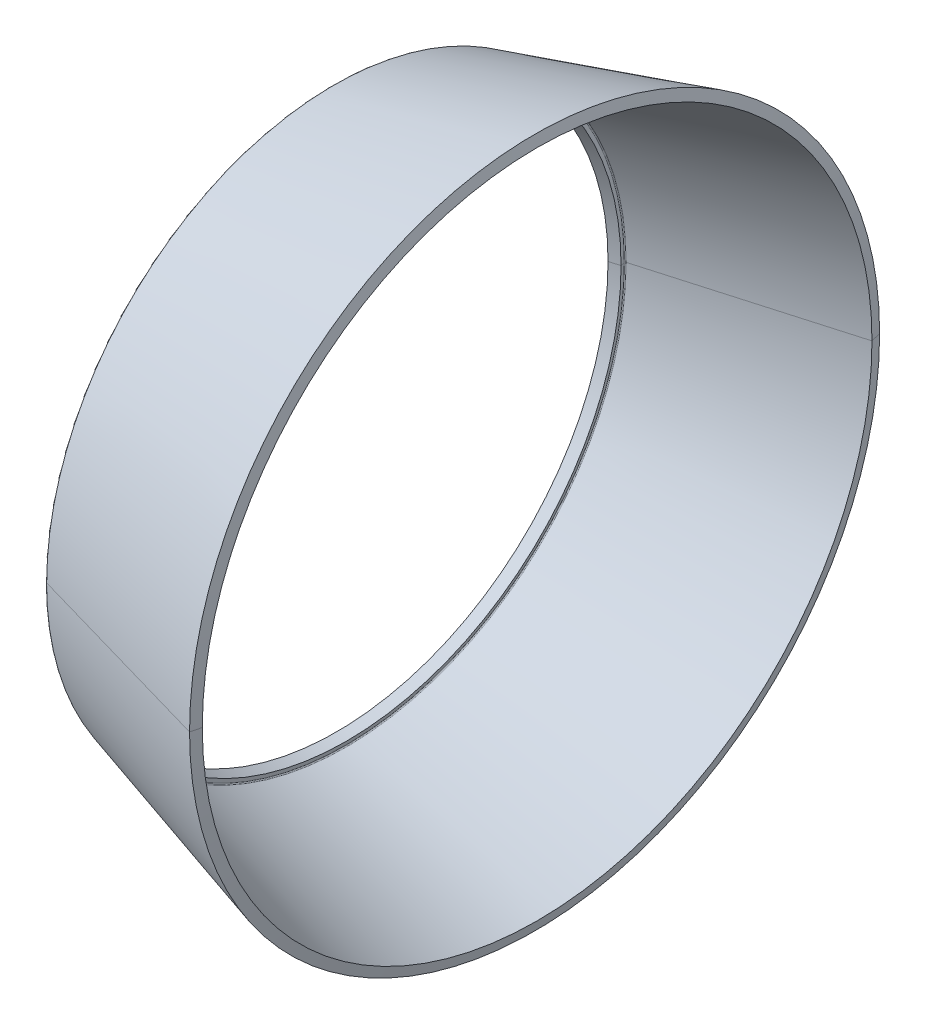
ISO-10303-21;
HEADER;
FILE_DESCRIPTION(('STEP AP214'),'2;1');
FILE_NAME('part.step','',(''),(''),'','','');
FILE_SCHEMA(('AUTOMOTIVE_DESIGN { 1 0 10303 214 1 1 1 1 }'));
ENDSEC;
DATA;
#1=APPLICATION_CONTEXT('core data for automotive mechanical design processes');
#2=APPLICATION_PROTOCOL_DEFINITION('international standard','automotive_design',2000,#1);
#3=PRODUCT_CONTEXT('',#1,'mechanical');
#4=PRODUCT('Part','Part','',(#3));
#5=PRODUCT_RELATED_PRODUCT_CATEGORY('part','',(#4));
#6=PRODUCT_DEFINITION_FORMATION('','',#4);
#7=PRODUCT_DEFINITION_CONTEXT('part definition',#1,'design');
#8=PRODUCT_DEFINITION('design','',#6,#7);
#9=PRODUCT_DEFINITION_SHAPE('','',#8);
#10=(LENGTH_UNIT() NAMED_UNIT(*) SI_UNIT(.MILLI.,.METRE.));
#11=(NAMED_UNIT(*) PLANE_ANGLE_UNIT() SI_UNIT($,.RADIAN.));
#12=(NAMED_UNIT(*) SI_UNIT($,.STERADIAN.) SOLID_ANGLE_UNIT());
#13=UNCERTAINTY_MEASURE_WITH_UNIT(LENGTH_MEASURE(1.E-05),#10,'distance_accuracy_value','');
#14=(GEOMETRIC_REPRESENTATION_CONTEXT(3) GLOBAL_UNCERTAINTY_ASSIGNED_CONTEXT((#13)) GLOBAL_UNIT_ASSIGNED_CONTEXT((#10,
#11,#12)) REPRESENTATION_CONTEXT('',''));
#15=CARTESIAN_POINT('',(0.,0.,0.));
#16=DIRECTION('',(0.,0.,1.));
#17=DIRECTION('',(1.,0.,0.));
#18=AXIS2_PLACEMENT_3D('',#15,#16,#17);
#19=CARTESIAN_POINT('',(19.537827678837,0.,0.));
#20=DIRECTION('',(1.,0.,0.));
#21=DIRECTION('',(0.,1.,0.));
#22=AXIS2_PLACEMENT_3D('',#19,#20,#21);
#23=CONICAL_SURFACE('',#22,32.850014997691,0.279985718604932);
#24=DIRECTION('',(0.96105938495696,0.,0.276341923323535));
#25=VECTOR('',#24,1.);
#26=CARTESIAN_POINT('',(0.444051428440808,0.,27.359812274391));
#27=LINE('',#26,#25);
#28=CARTESIAN_POINT('',(0.444051428440808,0.,27.359812274391));
#29=VERTEX_POINT('',#28);
#30=CARTESIAN_POINT('',(19.537827678837,0.,32.850014997691));
#31=VERTEX_POINT('',#30);
#32=EDGE_CURVE('E11',#29,#31,#27,.T.);
#33=ORIENTED_EDGE('',*,*,#32,.F.);
#34=CARTESIAN_POINT('',(0.444051428440819,0.,0.));
#35=DIRECTION('',(1.,0.,0.));
#36=DIRECTION('',(0.,0.,-1.));
#37=AXIS2_PLACEMENT_3D('',#34,#35,#36);
#38=CIRCLE('',#37,27.359812274391);
#39=CARTESIAN_POINT('',(0.444051428440815,-26.0207277481717,-8.4546469556951));
#40=VERTEX_POINT('',#39);
#41=EDGE_CURVE('E25',#29,#40,#38,.T.);
#42=ORIENTED_EDGE('',*,*,#41,.T.);
#43=CARTESIAN_POINT('',(0.444051428440819,0.,0.));
#44=DIRECTION('',(1.,0.,0.));
#45=DIRECTION('',(0.,0.,-1.));
#46=AXIS2_PLACEMENT_3D('',#43,#44,#45);
#47=CIRCLE('',#46,27.359812274391);
#48=CARTESIAN_POINT('',(0.444051428440819,0.,-27.359812274391));
#49=VERTEX_POINT('',#48);
#50=EDGE_CURVE('E385',#40,#49,#47,.T.);
#51=ORIENTED_EDGE('',*,*,#50,.T.);
#52=DIRECTION('',(0.96105938495696,0.,-0.276341923323535));
#53=VECTOR('',#52,1.);
#54=CARTESIAN_POINT('',(0.444051428440808,0.,-27.359812274391));
#55=LINE('',#54,#53);
#56=CARTESIAN_POINT('',(19.537827678837,0.,-32.850014997691));
#57=VERTEX_POINT('',#56);
#58=EDGE_CURVE('E125',#49,#57,#55,.T.);
#59=ORIENTED_EDGE('',*,*,#58,.T.);
#60=CARTESIAN_POINT('',(19.537827678837,0.,0.));
#61=DIRECTION('',(1.,0.,0.));
#62=DIRECTION('',(0.,0.,-1.));
#63=AXIS2_PLACEMENT_3D('',#60,#61,#62);
#64=CIRCLE('',#63,32.850014997691);
#65=EDGE_CURVE('E377',#31,#57,#64,.T.);
#66=ORIENTED_EDGE('',*,*,#65,.F.);
#67=EDGE_LOOP('',(#33,#42,#51,#59,#66));
#68=FACE_BOUND('',#67,.T.);
#69=ADVANCED_FACE('F17',(#68),#23,.T.);
#70=CARTESIAN_POINT('',(19.78050790391,0.,0.));
#71=DIRECTION('',(-1.,0.,0.));
#72=DIRECTION('',(0.,1.,0.));
#73=AXIS2_PLACEMENT_3D('',#70,#71,#72);
#74=CONICAL_SURFACE('',#73,31.879276566275,1.32582191298443);
#75=DIRECTION('',(-0.242531502591709,0.,-0.970143530747182));
#76=VECTOR('',#75,1.);
#77=CARTESIAN_POINT('',(19.78050790391,0.,-31.879276566275));
#78=LINE('',#77,#76);
#79=CARTESIAN_POINT('',(19.78050790391,0.,-31.879276566275));
#80=VERTEX_POINT('',#79);
#81=EDGE_CURVE('E372',#80,#57,#78,.T.);
#82=ORIENTED_EDGE('',*,*,#81,.F.);
#83=CARTESIAN_POINT('',(19.78050790391,0.,0.));
#84=DIRECTION('',(1.,0.,0.));
#85=DIRECTION('',(0.,0.,-1.));
#86=AXIS2_PLACEMENT_3D('',#83,#84,#85);
#87=CIRCLE('',#86,31.879276566275);
#88=CARTESIAN_POINT('',(19.78050790391,0.,31.879276566275));
#89=VERTEX_POINT('',#88);
#90=EDGE_CURVE('E367',#89,#80,#87,.T.);
#91=ORIENTED_EDGE('',*,*,#90,.F.);
#92=DIRECTION('',(-0.242531502591705,0.,0.970143530747183));
#93=VECTOR('',#92,1.);
#94=CARTESIAN_POINT('',(19.78050790391,0.,31.879276566275));
#95=LINE('',#94,#93);
#96=EDGE_CURVE('E362',#89,#31,#95,.T.);
#97=ORIENTED_EDGE('',*,*,#96,.T.);
#98=ORIENTED_EDGE('',*,*,#65,.T.);
#99=EDGE_LOOP('',(#82,#91,#97,#98));
#100=FACE_BOUND('',#99,.T.);
#101=ADVANCED_FACE('F426',(#100),#74,.T.);
#102=CARTESIAN_POINT('',(19.78050790391,0.,0.));
#103=DIRECTION('',(-1.,0.,0.));
#104=DIRECTION('',(0.,-1.,0.));
#105=AXIS2_PLACEMENT_3D('',#102,#103,#104);
#106=CONICAL_SURFACE('',#105,31.879276566275,1.32582191298443);
#107=ORIENTED_EDGE('',*,*,#81,.T.);
#108=CARTESIAN_POINT('',(19.537827678837,0.,0.));
#109=DIRECTION('',(1.,0.,0.));
#110=DIRECTION('',(0.,0.,-1.));
#111=AXIS2_PLACEMENT_3D('',#108,#109,#110);
#112=CIRCLE('',#111,32.850014997691);
#113=EDGE_CURVE('E357',#57,#31,#112,.T.);
#114=ORIENTED_EDGE('',*,*,#113,.T.);
#115=ORIENTED_EDGE('',*,*,#96,.F.);
#116=CARTESIAN_POINT('',(19.78050790391,0.,0.));
#117=DIRECTION('',(1.,0.,0.));
#118=DIRECTION('',(0.,0.,-1.));
#119=AXIS2_PLACEMENT_3D('',#116,#117,#118);
#120=CIRCLE('',#119,31.879276566275);
#121=EDGE_CURVE('E352',#80,#89,#120,.T.);
#122=ORIENTED_EDGE('',*,*,#121,.F.);
#123=EDGE_LOOP('',(#107,#114,#115,#122));
#124=FACE_BOUND('',#123,.T.);
#125=ADVANCED_FACE('F430',(#124),#106,.T.);
#126=CARTESIAN_POINT('',(1.6019810178151,0.,0.));
#127=DIRECTION('',(1.,0.,0.));
#128=DIRECTION('',(0.,-1.,0.));
#129=AXIS2_PLACEMENT_3D('',#126,#127,#128);
#130=CONICAL_SURFACE('',#129,26.652243605022,0.279985718604906);
#131=DIRECTION('',(0.961059384956967,0.,0.27634192332351));
#132=VECTOR('',#131,1.);
#133=CARTESIAN_POINT('',(1.6019810178151,0.,26.652243605022));
#134=LINE('',#133,#132);
#135=CARTESIAN_POINT('',(1.6019810178151,0.,26.652243605022));
#136=VERTEX_POINT('',#135);
#137=EDGE_CURVE('E340',#136,#89,#134,.T.);
#138=ORIENTED_EDGE('',*,*,#137,.F.);
#139=CARTESIAN_POINT('',(1.6019810178151,0.,0.));
#140=DIRECTION('',(1.,0.,0.));
#141=DIRECTION('',(0.,0.,-1.));
#142=AXIS2_PLACEMENT_3D('',#139,#140,#141);
#143=CIRCLE('',#142,26.652243605022);
#144=CARTESIAN_POINT('',(1.6019810178151,25.347789954442,8.23599621217281));
#145=VERTEX_POINT('',#144);
#146=EDGE_CURVE('E337',#145,#136,#143,.T.);
#147=ORIENTED_EDGE('',*,*,#146,.F.);
#148=CARTESIAN_POINT('',(1.6019810178151,0.,0.));
#149=DIRECTION('',(1.,0.,0.));
#150=DIRECTION('',(0.,0.,-1.));
#151=AXIS2_PLACEMENT_3D('',#148,#149,#150);
#152=CIRCLE('',#151,26.652243605022);
#153=CARTESIAN_POINT('',(1.6019810178151,0.,-26.652243605022));
#154=VERTEX_POINT('',#153);
#155=EDGE_CURVE('E330',#154,#145,#152,.T.);
#156=ORIENTED_EDGE('',*,*,#155,.F.);
#157=DIRECTION('',(0.961059384956967,0.,-0.27634192332351));
#158=VECTOR('',#157,1.);
#159=CARTESIAN_POINT('',(1.6019810178151,0.,-26.652243605022));
#160=LINE('',#159,#158);
#161=EDGE_CURVE('E338',#154,#80,#160,.T.);
#162=ORIENTED_EDGE('',*,*,#161,.T.);
#163=ORIENTED_EDGE('',*,*,#121,.T.);
#164=EDGE_LOOP('',(#138,#147,#156,#162,#163));
#165=FACE_BOUND('',#164,.T.);
#166=ADVANCED_FACE('F435',(#165),#130,.F.);
#167=CARTESIAN_POINT('',(1.6019810178151,0.,0.));
#168=DIRECTION('',(1.,0.,0.));
#169=DIRECTION('',(0.,1.,0.));
#170=AXIS2_PLACEMENT_3D('',#167,#168,#169);
#171=CONICAL_SURFACE('',#170,26.652243605022,0.279985718604906);
#172=ORIENTED_EDGE('',*,*,#137,.T.);
#173=ORIENTED_EDGE('',*,*,#90,.T.);
#174=ORIENTED_EDGE('',*,*,#161,.F.);
#175=CARTESIAN_POINT('',(1.6019810178151,0.,0.));
#176=DIRECTION('',(1.,0.,0.));
#177=DIRECTION('',(0.,0.,-1.));
#178=AXIS2_PLACEMENT_3D('',#175,#176,#177);
#179=CIRCLE('',#178,26.652243605022);
#180=CARTESIAN_POINT('',(1.6019810178151,-25.347789954442,-8.2359962121728));
#181=VERTEX_POINT('',#180);
#182=EDGE_CURVE('E333',#181,#154,#179,.T.);
#183=ORIENTED_EDGE('',*,*,#182,.F.);
#184=CARTESIAN_POINT('',(1.6019810178151,0.,0.));
#185=DIRECTION('',(1.,0.,0.));
#186=DIRECTION('',(0.,0.,-1.));
#187=AXIS2_PLACEMENT_3D('',#184,#185,#186);
#188=CIRCLE('',#187,26.652243605022);
#189=EDGE_CURVE('E447',#136,#181,#188,.T.);
#190=ORIENTED_EDGE('',*,*,#189,.F.);
#191=EDGE_LOOP('',(#172,#173,#174,#183,#190));
#192=FACE_BOUND('',#191,.T.);
#193=ADVANCED_FACE('F301',(#192),#171,.F.);
#194=CARTESIAN_POINT('',(1.62961521014821,0.,0.));
#195=DIRECTION('',(1.,0.,0.));
#196=DIRECTION('',(0.,0.309016994374947,-0.951056516295154));
#197=AXIS2_PLACEMENT_3D('',#194,#195,#196);
#198=TOROIDAL_SURFACE('',#197,26.5561376665258,0.100000000000678);
#199=CARTESIAN_POINT('',(1.62961521014821,-25.2563877753805,-8.20629784391713));
#200=DIRECTION('',(0.,0.309016994374948,-0.951056516295153));
#201=DIRECTION('',(-0.276341923329143,-0.914021790608395,-0.296983682554738));
#202=AXIS2_PLACEMENT_3D('',#199,#200,#201);
#203=CIRCLE('',#202,0.100000000000676);
#204=CARTESIAN_POINT('',(1.5326008570727,-25.2333216587862,-8.19880320832003));
#205=VERTEX_POINT('',#204);
#206=EDGE_CURVE('E448',#181,#205,#203,.T.);
#207=ORIENTED_EDGE('',*,*,#206,.T.);
#208=CARTESIAN_POINT('',(1.5326008570727,0.,0.));
#209=DIRECTION('',(1.,0.,0.));
#210=DIRECTION('',(0.,0.,1.));
#211=AXIS2_PLACEMENT_3D('',#208,#209,#210);
#212=CIRCLE('',#211,26.531884516267);
#213=CARTESIAN_POINT('',(1.5326008570727,0.,26.531884516267));
#214=VERTEX_POINT('',#213);
#215=EDGE_CURVE('E267',#214,#205,#212,.T.);
#216=ORIENTED_EDGE('',*,*,#215,.F.);
#217=CARTESIAN_POINT('',(1.5326008570727,0.,0.));
#218=DIRECTION('',(1.,0.,0.));
#219=DIRECTION('',(0.,0.951056516295156,0.309016994374939));
#220=AXIS2_PLACEMENT_3D('',#217,#218,#219);
#221=CIRCLE('',#220,26.531884516267);
#222=CARTESIAN_POINT('',(1.5326008570727,25.2333216587862,8.19880320832003));
#223=VERTEX_POINT('',#222);
#224=EDGE_CURVE('E242',#223,#214,#221,.T.);
#225=ORIENTED_EDGE('',*,*,#224,.F.);
#226=CARTESIAN_POINT('',(1.62961521014821,25.2563877753805,8.20629784391713));
#227=DIRECTION('',(0.,-0.309016994374948,0.951056516295153));
#228=DIRECTION('',(-0.276341923329141,0.914021790608396,0.296983682554738));
#229=AXIS2_PLACEMENT_3D('',#226,#227,#228);
#230=CIRCLE('',#229,0.100000000000676);
#231=EDGE_CURVE('E324',#145,#223,#230,.T.);
#232=ORIENTED_EDGE('',*,*,#231,.F.);
#233=ORIENTED_EDGE('',*,*,#146,.T.);
#234=ORIENTED_EDGE('',*,*,#189,.T.);
#235=EDGE_LOOP('',(#207,#216,#225,#232,#233,#234));
#236=FACE_BOUND('',#235,.T.);
#237=ADVANCED_FACE('F296',(#236),#198,.F.);
#238=CARTESIAN_POINT('',(1.62961521014821,0.,0.));
#239=DIRECTION('',(1.,0.,0.));
#240=DIRECTION('',(0.,-0.309016994374947,0.951056516295154));
#241=AXIS2_PLACEMENT_3D('',#238,#239,#240);
#242=TOROIDAL_SURFACE('',#241,26.5561376665258,0.100000000000678);
#243=ORIENTED_EDGE('',*,*,#206,.F.);
#244=ORIENTED_EDGE('',*,*,#182,.T.);
#245=ORIENTED_EDGE('',*,*,#155,.T.);
#246=ORIENTED_EDGE('',*,*,#231,.T.);
#247=CARTESIAN_POINT('',(1.5326008570727,0.,0.));
#248=DIRECTION('',(1.,0.,0.));
#249=DIRECTION('',(0.,0.,-1.));
#250=AXIS2_PLACEMENT_3D('',#247,#248,#249);
#251=CIRCLE('',#250,26.531884516267);
#252=CARTESIAN_POINT('',(1.5326008570727,0.,-26.531884516267));
#253=VERTEX_POINT('',#252);
#254=EDGE_CURVE('E326',#253,#223,#251,.T.);
#255=ORIENTED_EDGE('',*,*,#254,.F.);
#256=CARTESIAN_POINT('',(1.5326008570727,0.,0.));
#257=DIRECTION('',(1.,0.,0.));
#258=DIRECTION('',(0.,-0.951056516295153,-0.30901699437495));
#259=AXIS2_PLACEMENT_3D('',#256,#257,#258);
#260=CIRCLE('',#259,26.531884516267);
#261=EDGE_CURVE('E256',#205,#253,#260,.T.);
#262=ORIENTED_EDGE('',*,*,#261,.F.);
#263=EDGE_LOOP('',(#243,#244,#245,#246,#255,#262));
#264=FACE_BOUND('',#263,.T.);
#265=ADVANCED_FACE('F287',(#264),#242,.F.);
#266=CARTESIAN_POINT('',(1.6305224286618,0.,0.));
#267=DIRECTION('',(-1.,0.,0.));
#268=DIRECTION('',(0.,1.,0.));
#269=AXIS2_PLACEMENT_3D('',#266,#267,#268);
#270=CONICAL_SURFACE('',#269,26.140191156094,1.32582191298489);
#271=DIRECTION('',(-0.24253150259126,0.,-0.970143530747294));
#272=VECTOR('',#271,1.);
#273=CARTESIAN_POINT('',(1.63052242866181,0.,-26.140191156094));
#274=LINE('',#273,#272);
#275=CARTESIAN_POINT('',(1.6305224286618,0.,-26.140191156094));
#276=VERTEX_POINT('',#275);
#277=EDGE_CURVE('E276',#276,#253,#274,.T.);
#278=ORIENTED_EDGE('',*,*,#277,.F.);
#279=CARTESIAN_POINT('',(1.6305224286618,0.,0.));
#280=DIRECTION('',(1.,0.,0.));
#281=DIRECTION('',(0.,0.,-1.));
#282=AXIS2_PLACEMENT_3D('',#279,#280,#281);
#283=CIRCLE('',#282,26.140191156094);
#284=CARTESIAN_POINT('',(1.63052242866181,0.,26.140191156094));
#285=VERTEX_POINT('',#284);
#286=EDGE_CURVE('E270',#285,#276,#283,.T.);
#287=ORIENTED_EDGE('',*,*,#286,.F.);
#288=DIRECTION('',(-0.24253150259126,0.,0.970143530747294));
#289=VECTOR('',#288,1.);
#290=CARTESIAN_POINT('',(1.63052242866181,0.,26.140191156094));
#291=LINE('',#290,#289);
#292=EDGE_CURVE('E268',#285,#214,#291,.T.);
#293=ORIENTED_EDGE('',*,*,#292,.T.);
#294=ORIENTED_EDGE('',*,*,#215,.T.);
#295=ORIENTED_EDGE('',*,*,#261,.T.);
#296=EDGE_LOOP('',(#278,#287,#293,#294,#295));
#297=FACE_BOUND('',#296,.T.);
#298=ADVANCED_FACE('F222',(#297),#270,.T.);
#299=CARTESIAN_POINT('',(1.6305224286618,0.,0.));
#300=DIRECTION('',(-1.,0.,0.));
#301=DIRECTION('',(0.,-1.,0.));
#302=AXIS2_PLACEMENT_3D('',#299,#300,#301);
#303=CONICAL_SURFACE('',#302,26.140191156094,1.32582191298489);
#304=ORIENTED_EDGE('',*,*,#277,.T.);
#305=ORIENTED_EDGE('',*,*,#254,.T.);
#306=ORIENTED_EDGE('',*,*,#224,.T.);
#307=ORIENTED_EDGE('',*,*,#292,.F.);
#308=CARTESIAN_POINT('',(1.6305224286618,0.,0.));
#309=DIRECTION('',(1.,0.,0.));
#310=DIRECTION('',(0.,0.,-1.));
#311=AXIS2_PLACEMENT_3D('',#308,#309,#310);
#312=CIRCLE('',#311,26.140191156094);
#313=EDGE_CURVE('E271',#276,#285,#312,.T.);
#314=ORIENTED_EDGE('',*,*,#313,.F.);
#315=EDGE_LOOP('',(#304,#305,#306,#307,#314));
#316=FACE_BOUND('',#315,.T.);
#317=ADVANCED_FACE('F217',(#316),#303,.T.);
#318=CARTESIAN_POINT('',(0.66887371351522,0.,0.));
#319=DIRECTION('',(1.,0.,0.));
#320=DIRECTION('',(0.,-1.,0.));
#321=AXIS2_PLACEMENT_3D('',#318,#319,#320);
#322=CONICAL_SURFACE('',#321,25.863679777438,0.279985718604454);
#323=DIRECTION('',(0.961059384957092,0.,0.276341923323075));
#324=VECTOR('',#323,1.);
#325=CARTESIAN_POINT('',(0.66887371351522,0.,25.863679777438));
#326=LINE('',#325,#324);
#327=CARTESIAN_POINT('',(0.668873713515222,0.,25.863679777438));
#328=VERTEX_POINT('',#327);
#329=EDGE_CURVE('E413',#328,#285,#326,.T.);
#330=ORIENTED_EDGE('',*,*,#329,.F.);
#331=CARTESIAN_POINT('',(0.66887371351522,0.,0.));
#332=DIRECTION('',(1.,0.,0.));
#333=DIRECTION('',(0.,0.,-1.));
#334=AXIS2_PLACEMENT_3D('',#331,#332,#333);
#335=CIRCLE('',#334,25.863679777438);
#336=CARTESIAN_POINT('',(0.66887371351522,0.,-25.863679777438));
#337=VERTEX_POINT('',#336);
#338=EDGE_CURVE('E408',#337,#328,#335,.T.);
#339=ORIENTED_EDGE('',*,*,#338,.F.);
#340=DIRECTION('',(0.961059384957092,0.,-0.276341923323075));
#341=VECTOR('',#340,1.);
#342=CARTESIAN_POINT('',(0.66887371351522,0.,-25.863679777438));
#343=LINE('',#342,#341);
#344=EDGE_CURVE('E399',#337,#276,#343,.T.);
#345=ORIENTED_EDGE('',*,*,#344,.T.);
#346=ORIENTED_EDGE('',*,*,#313,.T.);
#347=EDGE_LOOP('',(#330,#339,#345,#346));
#348=FACE_BOUND('',#347,.T.);
#349=ADVANCED_FACE('F213',(#348),#322,.F.);
#350=CARTESIAN_POINT('',(0.66887371351522,0.,0.));
#351=DIRECTION('',(1.,0.,0.));
#352=DIRECTION('',(0.,1.,0.));
#353=AXIS2_PLACEMENT_3D('',#350,#351,#352);
#354=CONICAL_SURFACE('',#353,25.863679777438,0.279985718604454);
#355=ORIENTED_EDGE('',*,*,#329,.T.);
#356=ORIENTED_EDGE('',*,*,#286,.T.);
#357=ORIENTED_EDGE('',*,*,#344,.F.);
#358=CARTESIAN_POINT('',(0.66887371351522,0.,0.));
#359=DIRECTION('',(1.,0.,0.));
#360=DIRECTION('',(0.,0.,-1.));
#361=AXIS2_PLACEMENT_3D('',#358,#359,#360);
#362=CIRCLE('',#361,25.863679777438);
#363=EDGE_CURVE('E398',#328,#337,#362,.T.);
#364=ORIENTED_EDGE('',*,*,#363,.F.);
#365=EDGE_LOOP('',(#355,#356,#357,#364));
#366=FACE_BOUND('',#365,.T.);
#367=ADVANCED_FACE('F209',(#366),#354,.F.);
#368=CARTESIAN_POINT('',(0.339981187327261,0.,0.));
#369=DIRECTION('',(-1.,0.,0.));
#370=DIRECTION('',(0.,1.,0.));
#371=AXIS2_PLACEMENT_3D('',#368,#369,#370);
#372=CONICAL_SURFACE('',#371,27.179273641259,1.32582191298487);
#373=DIRECTION('',(-0.242531502591285,0.,-0.970143530747288));
#374=VECTOR('',#373,1.);
#375=CARTESIAN_POINT('',(0.668873713515222,0.,-25.863679777438));
#376=LINE('',#375,#374);
#377=CARTESIAN_POINT('',(0.339981187327261,0.,-27.179273641259));
#378=VERTEX_POINT('',#377);
#379=EDGE_CURVE('E397',#337,#378,#376,.T.);
#380=ORIENTED_EDGE('',*,*,#379,.T.);
#381=CARTESIAN_POINT('',(0.339981187327263,-25.8490253046885,-8.39885744991608));
#382=CARTESIAN_POINT('',(0.339981187327263,-25.739088148765,-8.73722173445648));
#383=CARTESIAN_POINT('',(0.339981187327263,-25.6225001114486,-9.07342474002727));
#384=CARTESIAN_POINT('',(0.339981187327263,-25.3762179823425,-9.74099567240559));
#385=CARTESIAN_POINT('',(0.339981187327263,-25.2465238905528,-10.0723635992131));
#386=CARTESIAN_POINT('',(0.339981187327263,-24.9742253608126,-10.7297518532409));
#387=CARTESIAN_POINT('',(0.339981187327263,-24.831620922862,-11.0557721804611));
#388=CARTESIAN_POINT('',(0.339981187327263,-24.5337227308047,-11.7019629577537));
#389=CARTESIAN_POINT('',(0.339981187327263,-24.3784289766979,-12.0221334078262));
#390=CARTESIAN_POINT('',(0.339981187327263,-24.0553912974275,-12.6561306380799));
#391=CARTESIAN_POINT('',(0.339981187327263,-23.8876473722639,-12.9699574182612));
#392=CARTESIAN_POINT('',(0.339981187327263,-23.5399680820109,-13.5907834408936));
#393=CARTESIAN_POINT('',(0.339981187327263,-23.3600327169216,-13.8977826833446));
#394=CARTESIAN_POINT('',(0.339981187327263,-22.9882479720943,-14.504480251815));
#395=CARTESIAN_POINT('',(0.339981187327263,-22.7963985923563,-14.8041785778343));
#396=CARTESIAN_POINT('',(0.339981187327263,-22.4010816419685,-15.3958122025212));
#397=CARTESIAN_POINT('',(0.339981187327263,-22.1976140713186,-15.6877475011888));
#398=CARTESIAN_POINT('',(0.339981187327263,-21.7793744697726,-16.2634049275184));
#399=CARTESIAN_POINT('',(0.339981187327263,-21.5646024388765,-16.5471270551804));
#400=CARTESIAN_POINT('',(0.339981187327263,-21.1240850801664,-17.105920660699));
#401=CARTESIAN_POINT('',(0.339981187327263,-20.8983397523523,-17.3809921385555));
#402=CARTESIAN_POINT('',(0.339981187327263,-20.4362238826258,-17.9220603041398));
#403=CARTESIAN_POINT('',(0.339981187327263,-20.1998533407133,-18.1880569918676));
#404=CARTESIAN_POINT('',(0.339981187327263,-19.7168515090637,-18.7105654295932));
#405=CARTESIAN_POINT('',(0.339981187327263,-19.4702202193265,-18.9670771795909));
#406=CARTESIAN_POINT('',(0.339981187327263,-18.9670771795917,-19.4702202193271));
#407=CARTESIAN_POINT('',(0.339981187327263,-18.7105654295941,-19.7168515090655));
#408=CARTESIAN_POINT('',(0.339981187327263,-18.1880569918669,-20.1998533407114));
#409=CARTESIAN_POINT('',(0.339981187327263,-17.9220603041373,-20.4362238826188));
#410=CARTESIAN_POINT('',(0.339981187327263,-17.3809921385581,-20.8983397523592));
#411=CARTESIAN_POINT('',(0.339981187327263,-17.1059206607086,-21.1240850801922));
#412=CARTESIAN_POINT('',(0.339981187327263,-16.5471270551709,-21.5646024388506));
#413=CARTESIAN_POINT('',(0.339981187327263,-16.2634049274828,-21.7793744696761));
#414=CARTESIAN_POINT('',(0.339981187327263,-15.6877475012244,-22.197614071415));
#415=CARTESIAN_POINT('',(0.339981187327263,-15.3958122026541,-22.4010816423284));
#416=CARTESIAN_POINT('',(0.339981187327263,-14.8041785777016,-22.7963985919964));
#417=CARTESIAN_POINT('',(0.339981187327263,-14.5044802513195,-22.988247970751));
#418=CARTESIAN_POINT('',(0.339981187327263,-13.8977826838403,-23.3600327182648));
#419=CARTESIAN_POINT('',(0.339981187327263,-13.5907834427431,-23.5399680870239));
#420=CARTESIAN_POINT('',(0.339981187327263,-12.9699574164118,-23.8876473672508));
#421=CARTESIAN_POINT('',(0.339981187327263,-12.6561306311777,-24.0553912787185));
#422=CARTESIAN_POINT('',(0.339981187327263,-12.0221334147285,-24.3784289954069));
#423=CARTESIAN_POINT('',(0.339981187327263,-11.7019629835135,-24.5337228006276));
#424=CARTESIAN_POINT('',(0.339981187327263,-11.0557721547015,-24.831620853039));
#425=CARTESIAN_POINT('',(0.339981187327263,-10.7297517571044,-24.9742251002297));
#426=CARTESIAN_POINT('',(0.339981187327263,-10.0723636953497,-25.2465241511357));
#427=CARTESIAN_POINT('',(0.339981187327263,-9.74099603119206,-25.3762189548509));
#428=CARTESIAN_POINT('',(0.339981187327263,-9.07342438124098,-25.6224991389401));
#429=CARTESIAN_POINT('',(0.339981187327263,-8.73722039544755,-25.739084519314));
#430=CARTESIAN_POINT('',(0.339981187327263,-8.06049450438477,-25.958966090063));
#431=CARTESIAN_POINT('',(0.339981187327263,-7.71997259911542,-26.0622622804381));
#432=CARTESIAN_POINT('',(0.339981187327263,-7.03513592926333,-26.2554061976345));
#433=CARTESIAN_POINT('',(0.339981187327263,-6.69082116468059,-26.3452539244558));
#434=CARTESIAN_POINT('',(0.339981187327263,-5.99892968436544,-26.5113623695796));
#435=CARTESIAN_POINT('',(0.339981187327263,-5.65135296863302,-26.5876230878821));
#436=CARTESIAN_POINT('',(0.339981187327263,-4.95347352504252,-26.7264399509145));
#437=CARTESIAN_POINT('',(0.339981187327263,-4.60317079718443,-26.7889960956443));
#438=CARTESIAN_POINT('',(0.339981187327263,-3.90037946732053,-26.9003072669882));
#439=CARTESIAN_POINT('',(0.339981187327263,-3.54789086531473,-26.9490622936023));
#440=CARTESIAN_POINT('',(0.339981187327263,-2.84127131186143,-27.0326963785592));
#441=CARTESIAN_POINT('',(0.339981187327263,-2.48714036041394,-27.067575436902));
#442=CARTESIAN_POINT('',(0.339981187327263,-1.77778210445191,-27.123402585592));
#443=CARTESIAN_POINT('',(0.339981187327263,-1.42255479993736,-27.1443506759392));
#444=CARTESIAN_POINT('',(0.339981187327263,-0.711551751305113,-27.172288136617));
#445=CARTESIAN_POINT('',(0.339981187327263,-0.355776007187417,-27.1792775069475));
#446=CARTESIAN_POINT('',(0.339981187327263,-1.04103941092441E-13,-27.179273641259));
#447=B_SPLINE_CURVE_WITH_KNOTS('',3,(#381,#382,#383,#384,#385,#386,#387,#388,#389,#390,#391,
#392,#393,#394,#395,#396,#397,#398,#399,#400,#401,#402,#403,#404,#405,#406,#407,#408,#409,#410,
#411,#412,#413,#414,#415,#416,#417,#418,#419,#420,#421,#422,#423,#424,#425,#426,#427,#428,#429,
#430,#431,#432,#433,#434,#435,#436,#437,#438,#439,#440,#441,#442,#443,#444,#445,#446),
.UNSPECIFIED.,.F.,.F.,(4,2,2,2,2,2,2,2,2,2,2,2,2,2,2,2,2,2,2,2,2,2,2,2,2,2,2,2,2,2,2,2,4),(0.,
1.06725899995148,2.13451799990295,3.20177699985444,4.26903599980591,5.33629499975739,
6.40355399970888,7.47081299966035,8.53807199961182,9.60533099956329,10.6725899995148,
11.7398489994663,12.8071079994177,13.8743669993692,14.9416259993207,16.0088849992722,
17.0761439992236,18.1434029991751,19.2106619991266,20.2779209990781,21.3451799990296,
22.412438998981,23.4796979989325,24.546956998884,25.6142159988355,26.681474998787,
27.7487339987384,28.8159929986899,29.8832519986414,30.9505109985929,32.0177699985443,
33.0850289984958,34.1522879984473),.UNSPECIFIED.);
#448=CARTESIAN_POINT('',(0.339981187327263,-25.8490253046885,-8.39885744991608));
#449=VERTEX_POINT('',#448);
#450=EDGE_CURVE('E161',#449,#378,#447,.T.);
#451=ORIENTED_EDGE('',*,*,#450,.F.);
#452=CARTESIAN_POINT('',(0.339981187327261,0.,0.));
#453=DIRECTION('',(1.,0.,0.));
#454=DIRECTION('',(0.,0.,-1.));
#455=AXIS2_PLACEMENT_3D('',#452,#453,#454);
#456=CIRCLE('',#455,27.179273641259);
#457=CARTESIAN_POINT('',(0.339981187327263,0.,27.179273641259));
#458=VERTEX_POINT('',#457);
#459=EDGE_CURVE('E189',#458,#449,#456,.T.);
#460=ORIENTED_EDGE('',*,*,#459,.F.);
#461=DIRECTION('',(-0.242531502591285,0.,0.970143530747288));
#462=VECTOR('',#461,1.);
#463=CARTESIAN_POINT('',(0.668873713515222,0.,25.863679777438));
#464=LINE('',#463,#462);
#465=EDGE_CURVE('E187',#328,#458,#464,.T.);
#466=ORIENTED_EDGE('',*,*,#465,.F.);
#467=ORIENTED_EDGE('',*,*,#363,.T.);
#468=EDGE_LOOP('',(#380,#451,#460,#466,#467));
#469=FACE_BOUND('',#468,.T.);
#470=ADVANCED_FACE('F200',(#469),#372,.F.);
#471=CARTESIAN_POINT('',(0.339981187327261,0.,0.));
#472=DIRECTION('',(-1.,0.,0.));
#473=DIRECTION('',(0.,-1.,0.));
#474=AXIS2_PLACEMENT_3D('',#471,#472,#473);
#475=CONICAL_SURFACE('',#474,27.179273641259,1.32582191298487);
#476=ORIENTED_EDGE('',*,*,#379,.F.);
#477=ORIENTED_EDGE('',*,*,#338,.T.);
#478=ORIENTED_EDGE('',*,*,#465,.T.);
#479=CARTESIAN_POINT('',(0.339981187327263,25.8490253046885,8.39885744991609));
#480=CARTESIAN_POINT('',(0.339981187327263,25.739088148765,8.73722173445649));
#481=CARTESIAN_POINT('',(0.339981187327263,25.6225001114486,9.07342474002728));
#482=CARTESIAN_POINT('',(0.339981187327263,25.3762179823425,9.7409956724056));
#483=CARTESIAN_POINT('',(0.339981187327263,25.2465238905528,10.0723635992131));
#484=CARTESIAN_POINT('',(0.339981187327263,24.9742253608126,10.7297518532409));
#485=CARTESIAN_POINT('',(0.339981187327263,24.831620922862,11.0557721804611));
#486=CARTESIAN_POINT('',(0.339981187327263,24.5337227308047,11.7019629577538));
#487=CARTESIAN_POINT('',(0.339981187327263,24.3784289766979,12.0221334078262));
#488=CARTESIAN_POINT('',(0.339981187327263,24.0553912974275,12.6561306380799));
#489=CARTESIAN_POINT('',(0.339981187327263,23.8876473722639,12.9699574182613));
#490=CARTESIAN_POINT('',(0.339981187327263,23.5399680820109,13.5907834408936));
#491=CARTESIAN_POINT('',(0.339981187327263,23.3600327169216,13.8977826833447));
#492=CARTESIAN_POINT('',(0.339981187327263,22.9882479720943,14.504480251815));
#493=CARTESIAN_POINT('',(0.339981187327263,22.7963985923563,14.8041785778344));
#494=CARTESIAN_POINT('',(0.339981187327263,22.4010816419685,15.3958122025212));
#495=CARTESIAN_POINT('',(0.339981187327263,22.1976140713186,15.6877475011888));
#496=CARTESIAN_POINT('',(0.339981187327263,21.7793744697726,16.2634049275184));
#497=CARTESIAN_POINT('',(0.339981187327263,21.5646024388765,16.5471270551804));
#498=CARTESIAN_POINT('',(0.339981187327263,21.1240850801664,17.105920660699));
#499=CARTESIAN_POINT('',(0.339981187327263,20.8983397523523,17.3809921385555));
#500=CARTESIAN_POINT('',(0.339981187327263,20.4362238826258,17.9220603041398));
#501=CARTESIAN_POINT('',(0.339981187327263,20.1998533407133,18.1880569918677));
#502=CARTESIAN_POINT('',(0.339981187327263,19.7168515090636,18.7105654295932));
#503=CARTESIAN_POINT('',(0.339981187327263,19.4702202193264,18.967077179591));
#504=CARTESIAN_POINT('',(0.339981187327263,18.9670771795916,19.4702202193271));
#505=CARTESIAN_POINT('',(0.339981187327263,18.710565429594,19.7168515090656));
#506=CARTESIAN_POINT('',(0.339981187327263,18.1880569918668,20.1998533407114));
#507=CARTESIAN_POINT('',(0.339981187327263,17.9220603041372,20.4362238826188));
#508=CARTESIAN_POINT('',(0.339981187327263,17.3809921385581,20.8983397523592));
#509=CARTESIAN_POINT('',(0.339981187327263,17.1059206607085,21.1240850801922));
#510=CARTESIAN_POINT('',(0.339981187327263,16.5471270551709,21.5646024388507));
#511=CARTESIAN_POINT('',(0.339981187327263,16.2634049274828,21.7793744696762));
#512=CARTESIAN_POINT('',(0.339981187327263,15.6877475012244,22.197614071415));
#513=CARTESIAN_POINT('',(0.339981187327263,15.395812202654,22.4010816423284));
#514=CARTESIAN_POINT('',(0.339981187327263,14.8041785777016,22.7963985919964));
#515=CARTESIAN_POINT('',(0.339981187327263,14.5044802513195,22.988247970751));
#516=CARTESIAN_POINT('',(0.339981187327263,13.8977826838402,23.3600327182648));
#517=CARTESIAN_POINT('',(0.339981187327263,13.5907834427431,23.539968087024));
#518=CARTESIAN_POINT('',(0.339981187327263,12.9699574164118,23.8876473672508));
#519=CARTESIAN_POINT('',(0.339981187327263,12.6561306311776,24.0553912787185));
#520=CARTESIAN_POINT('',(0.339981187327263,12.0221334147285,24.3784289954069));
#521=CARTESIAN_POINT('',(0.339981187327263,11.7019629835134,24.5337228006276));
#522=CARTESIAN_POINT('',(0.339981187327263,11.0557721547014,24.831620853039));
#523=CARTESIAN_POINT('',(0.339981187327263,10.7297517571043,24.9742251002297));
#524=CARTESIAN_POINT('',(0.339981187327263,10.0723636953496,25.2465241511357));
#525=CARTESIAN_POINT('',(0.339981187327263,9.74099603119196,25.376218954851));
#526=CARTESIAN_POINT('',(0.339981187327263,9.07342438124087,25.6224991389401));
#527=CARTESIAN_POINT('',(0.339981187327263,8.73722039544745,25.739084519314));
#528=CARTESIAN_POINT('',(0.339981187327263,8.06049450438467,25.958966090063));
#529=CARTESIAN_POINT('',(0.339981187327263,7.71997259911532,26.0622622804381));
#530=CARTESIAN_POINT('',(0.339981187327263,7.03513592926322,26.2554061976345));
#531=CARTESIAN_POINT('',(0.339981187327263,6.69082116468047,26.3452539244558));
#532=CARTESIAN_POINT('',(0.339981187327263,5.99892968436531,26.5113623695796));
#533=CARTESIAN_POINT('',(0.339981187327263,5.6513529686329,26.5876230878822));
#534=CARTESIAN_POINT('',(0.339981187327263,4.9534735250424,26.7264399509145));
#535=CARTESIAN_POINT('',(0.339981187327263,4.60317079718431,26.7889960956443));
#536=CARTESIAN_POINT('',(0.339981187327263,3.90037946732041,26.9003072669882));
#537=CARTESIAN_POINT('',(0.339981187327263,3.5478908653146,26.9490622936023));
#538=CARTESIAN_POINT('',(0.339981187327263,2.8412713118613,27.0326963785592));
#539=CARTESIAN_POINT('',(0.339981187327263,2.48714036041381,27.067575436902));
#540=CARTESIAN_POINT('',(0.339981187327263,1.77778210445177,27.123402585592));
#541=CARTESIAN_POINT('',(0.339981187327263,1.42255479993722,27.1443506759393));
#542=CARTESIAN_POINT('',(0.339981187327263,0.711551751304974,27.172288136617));
#543=CARTESIAN_POINT('',(0.339981187327263,0.355776007187273,27.1792775069475));
#544=CARTESIAN_POINT('',(0.339981187327263,0.,27.179273641259));
#545=B_SPLINE_CURVE_WITH_KNOTS('',3,(#479,#480,#481,#482,#483,#484,#485,#486,#487,#488,#489,
#490,#491,#492,#493,#494,#495,#496,#497,#498,#499,#500,#501,#502,#503,#504,#505,#506,#507,#508,
#509,#510,#511,#512,#513,#514,#515,#516,#517,#518,#519,#520,#521,#522,#523,#524,#525,#526,#527,
#528,#529,#530,#531,#532,#533,#534,#535,#536,#537,#538,#539,#540,#541,#542,#543,#544),
.UNSPECIFIED.,.F.,.F.,(4,2,2,2,2,2,2,2,2,2,2,2,2,2,2,2,2,2,2,2,2,2,2,2,2,2,2,2,2,2,2,2,4),(0.,
1.06725899995148,2.13451799990296,3.20177699985445,4.26903599980593,5.33629499975741,
6.4035539997089,7.47081299966038,8.53807199961186,9.60533099956334,10.6725899995148,
11.7398489994663,12.8071079994178,13.8743669993693,14.9416259993208,16.0088849992722,
17.0761439992237,18.1434029991752,19.2106619991267,20.2779209990782,21.3451799990296,
22.4124389989811,23.4796979989326,24.5469569988841,25.6142159988356,26.6814749987871,
27.7487339987385,28.81599299869,29.8832519986415,30.950510998593,32.0177699985445,
33.085028998496,34.1522879984474),.UNSPECIFIED.);
#546=CARTESIAN_POINT('',(0.339981187327263,25.8490253046885,8.39885744991609));
#547=VERTEX_POINT('',#546);
#548=EDGE_CURVE('E186',#547,#458,#545,.T.);
#549=ORIENTED_EDGE('',*,*,#548,.F.);
#550=CARTESIAN_POINT('',(0.339981187327263,0.,-27.179273641259));
#551=CARTESIAN_POINT('',(0.339981187327263,0.53366490729223,-27.1792931924378));
#552=CARTESIAN_POINT('',(0.339981187327263,1.06732781754143,-27.1635566386864));
#553=CARTESIAN_POINT('',(0.339981187327263,2.1328035462915,-27.1007117330511));
#554=CARTESIAN_POINT('',(0.339981187327263,2.66461636479236,-27.0536033811672));
#555=CARTESIAN_POINT('',(0.339981187327263,3.72454581238355,-26.9281552909944));
#556=CARTESIAN_POINT('',(0.339981187327263,4.25266244147387,-26.8498155527056));
#557=CARTESIAN_POINT('',(0.339981187327263,5.30336795342845,-26.6621825949758));
#558=CARTESIAN_POINT('',(0.339981187327263,5.82595683629271,-26.5528893755348));
#559=CARTESIAN_POINT('',(0.339981187327263,6.86379401275308,-26.3037269185006));
#560=CARTESIAN_POINT('',(0.339981187327263,7.37904230634917,-26.1638576809075));
#561=CARTESIAN_POINT('',(0.339981187327263,8.40041104757792,-25.8540288055405));
#562=CARTESIAN_POINT('',(0.339981187327263,8.90653149521058,-25.6840691677666));
#563=CARTESIAN_POINT('',(0.339981187327263,9.90788891722222,-25.3146489260245));
#564=CARTESIAN_POINT('',(0.339981187327263,10.4031258916012,-25.1151883220563));
#565=CARTESIAN_POINT('',(0.339981187327263,11.3809985010497,-24.6874580645692));
#566=CARTESIAN_POINT('',(0.339981187327263,11.8636341361192,-24.4591884110503));
#567=CARTESIAN_POINT('',(0.339981187327263,12.8146299097869,-23.9746318630752));
#568=CARTESIAN_POINT('',(0.339981187327263,13.282990048385,-23.718344968619));
#569=CARTESIAN_POINT('',(0.339981187327263,14.2038101911359,-23.178642943809));
#570=CARTESIAN_POINT('',(0.339981187327263,14.6562701952887,-22.8952278134551));
#571=CARTESIAN_POINT('',(0.339981187327263,15.5437205850668,-22.3022524208698));
#572=CARTESIAN_POINT('',(0.339981187327263,15.9787109706921,-21.9926921586383));
#573=CARTESIAN_POINT('',(0.339981187327263,16.8297132376357,-21.3485002987936));
#574=CARTESIAN_POINT('',(0.339981187327263,17.2457251189541,-21.0138687011804));
#575=CARTESIAN_POINT('',(0.339981187327263,18.0573273237412,-20.3206949337977));
#576=CARTESIAN_POINT('',(0.339981187327263,18.45291764721,-19.9621527640284));
#577=CARTESIAN_POINT('',(0.339981187327263,19.2223045206426,-19.2224015561205));
#578=CARTESIAN_POINT('',(0.339981187327263,19.5961010706064,-18.8411925179819));
#579=CARTESIAN_POINT('',(0.339981187327263,20.3206037791705,-18.057429903479));
#580=CARTESIAN_POINT('',(0.339981187327263,20.6713099377707,-17.6548763271146));
#581=CARTESIAN_POINT('',(0.339981187327263,21.3484153412283,-16.8298210058068));
#582=CARTESIAN_POINT('',(0.339981187327263,21.6748145860856,-16.4073192608634));
#583=CARTESIAN_POINT('',(0.339981187327263,22.3021739550055,-15.5438331678439));
#584=CARTESIAN_POINT('',(0.339981187327263,22.603134079068,-15.1028488197679));
#585=CARTESIAN_POINT('',(0.339981187327263,23.1785712420503,-14.2039271980073));
#586=CARTESIAN_POINT('',(0.339981187327263,23.4530482809701,-13.7459899243227));
#587=CARTESIAN_POINT('',(0.339981187327263,23.9745671733046,-12.8147509348323));
#588=CARTESIAN_POINT('',(0.339981187327263,24.2216090267194,-12.3414492190264));
#589=CARTESIAN_POINT('',(0.339981187327263,24.6874006142977,-11.3811231246434));
#590=CARTESIAN_POINT('',(0.339981187327263,24.9061503484613,-10.8940987460663));
#591=CARTESIAN_POINT('',(0.339981187327263,25.314598902904,-9.90801670638785));
#592=CARTESIAN_POINT('',(0.339981187327263,25.5042977231831,-9.4089590452865));
#593=CARTESIAN_POINT('',(0.339981187327263,25.8539864264955,-8.40054156159779));
#594=CARTESIAN_POINT('',(0.339981187327263,26.0139763095289,-7.89118173901042));
#595=CARTESIAN_POINT('',(0.339981187327263,26.3036921685437,-6.86392678936828));
#596=CARTESIAN_POINT('',(0.339981187327263,26.4334181445252,-6.34603166231353));
#597=CARTESIAN_POINT('',(0.339981187327263,26.6621561992057,-5.30350256764955));
#598=CARTESIAN_POINT('',(0.339981187327263,26.7611682779047,-4.77886860004034));
#599=CARTESIAN_POINT('',(0.339981187327263,26.9281350847278,-3.72468166446461));
#600=CARTESIAN_POINT('',(0.339981187327263,26.996089812852,-3.1951286964981));
#601=CARTESIAN_POINT('',(0.339981187327263,27.1007062067984,-2.13294066060368));
#602=CARTESIAN_POINT('',(0.339981187327263,27.1373678726206,-1.60030559267577));
#603=CARTESIAN_POINT('',(0.339981187327263,27.1792709399356,-0.533800958566672));
#604=CARTESIAN_POINT('',(0.339981187327263,27.1845123414285,6.86076145225934E-05));
#605=CARTESIAN_POINT('',(0.339981187327263,27.1635568137197,1.0671903923368));
#606=CARTESIAN_POINT('',(0.339981187327263,27.137359884518,1.60044261087788));
#607=CARTESIAN_POINT('',(0.339981187327263,27.053618137976,2.66447985398764));
#608=CARTESIAN_POINT('',(0.339981187327263,26.9960733206358,3.19526487855631));
#609=CARTESIAN_POINT('',(0.339981187327263,26.8498370084791,4.2525269750513));
#610=CARTESIAN_POINT('',(0.339981187327263,26.7611455136626,4.77900404697761));
#611=CARTESIAN_POINT('',(0.339981187327263,26.5529175251341,5.82582244669761));
#612=CARTESIAN_POINT('',(0.339981187327263,26.4333810314221,6.34616377449129));
#613=CARTESIAN_POINT('',(0.339981187327263,26.1638999811647,7.37891155312457));
#614=CARTESIAN_POINT('',(0.339981187327263,26.0139554246193,7.89131800396417));
#615=CARTESIAN_POINT('',(0.339981187327263,25.8490253046885,8.39885744991601));
#616=B_SPLINE_CURVE_WITH_KNOTS('',3,(#550,#551,#552,#553,#554,#555,#556,#557,#558,#559,#560,
#561,#562,#563,#564,#565,#566,#567,#568,#569,#570,#571,#572,#573,#574,#575,#576,#577,#578,#579,
#580,#581,#582,#583,#584,#585,#586,#587,#588,#589,#590,#591,#592,#593,#594,#595,#596,#597,#598,
#599,#600,#601,#602,#603,#604,#605,#606,#607,#608,#609,#610,#611,#612,#613,#614,#615),
.UNSPECIFIED.,.F.,.F.,(4,2,2,2,2,2,2,2,2,2,2,2,2,2,2,2,2,2,2,2,2,2,2,2,2,2,2,2,2,2,2,2,4),(0.,
1.60075991788319,3.20151983576637,4.80227975364957,6.40303967153275,8.00379958941593,
9.60455950729911,11.2053194251823,12.8060793430655,14.4068392609487,16.0075991788319,
17.6083590967151,19.2091190145982,20.8098789324814,22.4106388503646,24.0113987682478,
25.612158686131,27.2129186040142,28.8136785218973,30.4144384397805,32.0151983576637,
33.6159582755469,35.2167181934301,36.8174781113133,38.4182380291965,40.0189979470796,
41.6197578649628,43.220517782846,44.8212777007292,46.4220376186124,48.0227975364956,
49.6235574543788,51.224317372262),.UNSPECIFIED.);
#617=EDGE_CURVE('E113',#378,#547,#616,.T.);
#618=ORIENTED_EDGE('',*,*,#617,.F.);
#619=EDGE_LOOP('',(#476,#477,#478,#549,#618));
#620=FACE_BOUND('',#619,.T.);
#621=ADVANCED_FACE('F147',(#620),#475,.F.);
#622=CARTESIAN_POINT('',(0.485502716938778,0.,0.));
#623=DIRECTION('',(1.,0.,0.));
#624=DIRECTION('',(0.,-0.309016994374947,0.951056516295154));
#625=AXIS2_PLACEMENT_3D('',#622,#623,#624);
#626=TOROIDAL_SURFACE('',#625,27.2156533666478,0.149999999999476);
#627=CARTESIAN_POINT('',(0.485502716938778,-25.8836244795806,-8.41009940331193));
#628=DIRECTION('',(0.,0.309016994374943,-0.951056516295155));
#629=DIRECTION('',(-0.27634192332072,-0.9140217906107,-0.296983682555481));
#630=AXIS2_PLACEMENT_3D('',#627,#628,#629);
#631=CIRCLE('',#630,0.149999999999476);
#632=EDGE_CURVE('E117',#40,#449,#631,.T.);
#633=ORIENTED_EDGE('',*,*,#632,.T.);
#634=ORIENTED_EDGE('',*,*,#450,.T.);
#635=ORIENTED_EDGE('',*,*,#617,.T.);
#636=CARTESIAN_POINT('',(0.485502716938778,25.8836244795806,8.41009940331194));
#637=DIRECTION('',(0.,-0.309016994374943,0.951056516295155));
#638=DIRECTION('',(-0.276341923320719,0.914021790610701,0.296983682555481));
#639=AXIS2_PLACEMENT_3D('',#636,#637,#638);
#640=CIRCLE('',#639,0.149999999999476);
#641=CARTESIAN_POINT('',(0.444051428440815,26.0207277481717,8.4546469556951));
#642=VERTEX_POINT('',#641);
#643=EDGE_CURVE('E103',#642,#547,#640,.T.);
#644=ORIENTED_EDGE('',*,*,#643,.F.);
#645=CARTESIAN_POINT('',(0.444051428440819,0.,0.));
#646=DIRECTION('',(1.,0.,0.));
#647=DIRECTION('',(0.,0.,-1.));
#648=AXIS2_PLACEMENT_3D('',#645,#646,#647);
#649=CIRCLE('',#648,27.359812274391);
#650=EDGE_CURVE('E109',#49,#642,#649,.T.);
#651=ORIENTED_EDGE('',*,*,#650,.F.);
#652=ORIENTED_EDGE('',*,*,#50,.F.);
#653=EDGE_LOOP('',(#633,#634,#635,#644,#651,#652));
#654=FACE_BOUND('',#653,.T.);
#655=ADVANCED_FACE('F106',(#654),#626,.T.);
#656=CARTESIAN_POINT('',(19.537827678837,0.,0.));
#657=DIRECTION('',(1.,0.,0.));
#658=DIRECTION('',(0.,-1.,0.));
#659=AXIS2_PLACEMENT_3D('',#656,#657,#658);
#660=CONICAL_SURFACE('',#659,32.850014997691,0.279985718604932);
#661=ORIENTED_EDGE('',*,*,#32,.T.);
#662=ORIENTED_EDGE('',*,*,#113,.F.);
#663=ORIENTED_EDGE('',*,*,#58,.F.);
#664=ORIENTED_EDGE('',*,*,#650,.T.);
#665=CARTESIAN_POINT('',(0.444051428440819,0.,0.));
#666=DIRECTION('',(1.,0.,0.));
#667=DIRECTION('',(0.,0.,-1.));
#668=AXIS2_PLACEMENT_3D('',#665,#666,#667);
#669=CIRCLE('',#668,27.359812274391);
#670=EDGE_CURVE('E119',#642,#29,#669,.T.);
#671=ORIENTED_EDGE('',*,*,#670,.T.);
#672=EDGE_LOOP('',(#661,#662,#663,#664,#671));
#673=FACE_BOUND('',#672,.T.);
#674=ADVANCED_FACE('F123',(#673),#660,.T.);
#675=CARTESIAN_POINT('',(0.485502716938778,0.,0.));
#676=DIRECTION('',(1.,0.,0.));
#677=DIRECTION('',(0.,0.309016994374947,-0.951056516295154));
#678=AXIS2_PLACEMENT_3D('',#675,#676,#677);
#679=TOROIDAL_SURFACE('',#678,27.2156533666478,0.149999999999476);
#680=ORIENTED_EDGE('',*,*,#632,.F.);
#681=ORIENTED_EDGE('',*,*,#41,.F.);
#682=ORIENTED_EDGE('',*,*,#670,.F.);
#683=ORIENTED_EDGE('',*,*,#643,.T.);
#684=ORIENTED_EDGE('',*,*,#548,.T.);
#685=ORIENTED_EDGE('',*,*,#459,.T.);
#686=EDGE_LOOP('',(#680,#681,#682,#683,#684,#685));
#687=FACE_BOUND('',#686,.T.);
#688=ADVANCED_FACE('F120',(#687),#679,.T.);
#689=CLOSED_SHELL('',(#69,#101,#125,#166,#193,#237,#265,#298,#317,#349,#367,#470,#621,#655,#674,#688));
#690=MANIFOLD_SOLID_BREP('B1',#689);
#691=ADVANCED_BREP_SHAPE_REPRESENTATION('',(#18,#690),#14);
#692=SHAPE_DEFINITION_REPRESENTATION(#9,#691);
ENDSEC;
END-ISO-10303-21;
